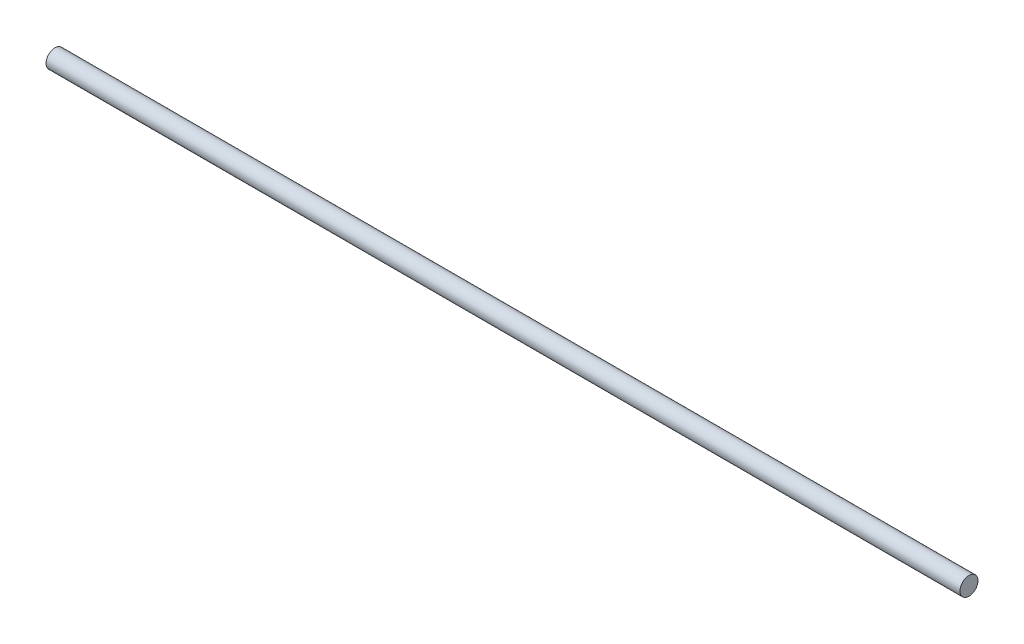
ISO-10303-21;
HEADER;
FILE_DESCRIPTION(('STEP AP214'),'2;1');
FILE_NAME('part.step','',(''),(''),'','','');
FILE_SCHEMA(('AUTOMOTIVE_DESIGN { 1 0 10303 214 1 1 1 1 }'));
ENDSEC;
DATA;
#1=APPLICATION_CONTEXT('core data for automotive mechanical design processes');
#2=APPLICATION_PROTOCOL_DEFINITION('international standard','automotive_design',2000,#1);
#3=PRODUCT_CONTEXT('',#1,'mechanical');
#4=PRODUCT('Part','Part','',(#3));
#5=PRODUCT_RELATED_PRODUCT_CATEGORY('part','',(#4));
#6=PRODUCT_DEFINITION_FORMATION('','',#4);
#7=PRODUCT_DEFINITION_CONTEXT('part definition',#1,'design');
#8=PRODUCT_DEFINITION('design','',#6,#7);
#9=PRODUCT_DEFINITION_SHAPE('','',#8);
#10=(LENGTH_UNIT() NAMED_UNIT(*) SI_UNIT(.MILLI.,.METRE.));
#11=(NAMED_UNIT(*) PLANE_ANGLE_UNIT() SI_UNIT($,.RADIAN.));
#12=(NAMED_UNIT(*) SI_UNIT($,.STERADIAN.) SOLID_ANGLE_UNIT());
#13=UNCERTAINTY_MEASURE_WITH_UNIT(LENGTH_MEASURE(1.E-05),#10,'distance_accuracy_value','');
#14=(GEOMETRIC_REPRESENTATION_CONTEXT(3) GLOBAL_UNCERTAINTY_ASSIGNED_CONTEXT((#13)) GLOBAL_UNIT_ASSIGNED_CONTEXT((#10,
#11,#12)) REPRESENTATION_CONTEXT('',''));
#15=CARTESIAN_POINT('',(0.,0.,0.));
#16=DIRECTION('',(0.,0.,1.));
#17=DIRECTION('',(1.,0.,0.));
#18=AXIS2_PLACEMENT_3D('',#15,#16,#17);
#19=CARTESIAN_POINT('',(202.5,0.,0.));
#20=DIRECTION('',(-1.,0.,0.));
#21=DIRECTION('',(0.,0.,1.));
#22=AXIS2_PLACEMENT_3D('',#19,#20,#21);
#23=CYLINDRICAL_SURFACE('',#22,4.);
#24=CARTESIAN_POINT('',(202.5,0.,0.));
#25=DIRECTION('',(1.,0.,0.));
#26=DIRECTION('',(0.,0.,-1.));
#27=AXIS2_PLACEMENT_3D('',#24,#25,#26);
#28=CIRCLE('',#27,4.);
#29=CARTESIAN_POINT('',(202.5,0.,-4.));
#30=VERTEX_POINT('',#29);
#31=EDGE_CURVE('E10',#30,#30,#28,.T.);
#32=ORIENTED_EDGE('',*,*,#31,.F.);
#33=EDGE_LOOP('',(#32));
#34=FACE_BOUND('',#33,.T.);
#35=CARTESIAN_POINT('',(-202.5,0.,0.));
#36=DIRECTION('',(1.,0.,0.));
#37=DIRECTION('',(0.,0.,-1.));
#38=AXIS2_PLACEMENT_3D('',#35,#36,#37);
#39=CIRCLE('',#38,4.);
#40=CARTESIAN_POINT('',(-202.5,0.,-4.));
#41=VERTEX_POINT('',#40);
#42=EDGE_CURVE('E34',#41,#41,#39,.T.);
#43=ORIENTED_EDGE('',*,*,#42,.T.);
#44=EDGE_LOOP('',(#43));
#45=FACE_BOUND('',#44,.T.);
#46=ADVANCED_FACE('F31',(#34,#45),#23,.T.);
#47=CARTESIAN_POINT('',(202.5,0.,0.));
#48=DIRECTION('',(1.,0.,0.));
#49=DIRECTION('',(0.,0.,-1.));
#50=AXIS2_PLACEMENT_3D('',#47,#48,#49);
#51=PLANE('',#50);
#52=ORIENTED_EDGE('',*,*,#31,.T.);
#53=EDGE_LOOP('',(#52));
#54=FACE_BOUND('',#53,.T.);
#55=ADVANCED_FACE('F46',(#54),#51,.T.);
#56=CARTESIAN_POINT('',(-202.5,0.,0.));
#57=DIRECTION('',(1.,0.,0.));
#58=DIRECTION('',(0.,0.,-1.));
#59=AXIS2_PLACEMENT_3D('',#56,#57,#58);
#60=PLANE('',#59);
#61=ORIENTED_EDGE('',*,*,#42,.F.);
#62=EDGE_LOOP('',(#61));
#63=FACE_BOUND('',#62,.T.);
#64=ADVANCED_FACE('F44',(#63),#60,.F.);
#65=CLOSED_SHELL('',(#46,#55,#64));
#66=MANIFOLD_SOLID_BREP('B2',#65);
#67=ADVANCED_BREP_SHAPE_REPRESENTATION('',(#18,#66),#14);
#68=SHAPE_DEFINITION_REPRESENTATION(#9,#67);
ENDSEC;
END-ISO-10303-21;
